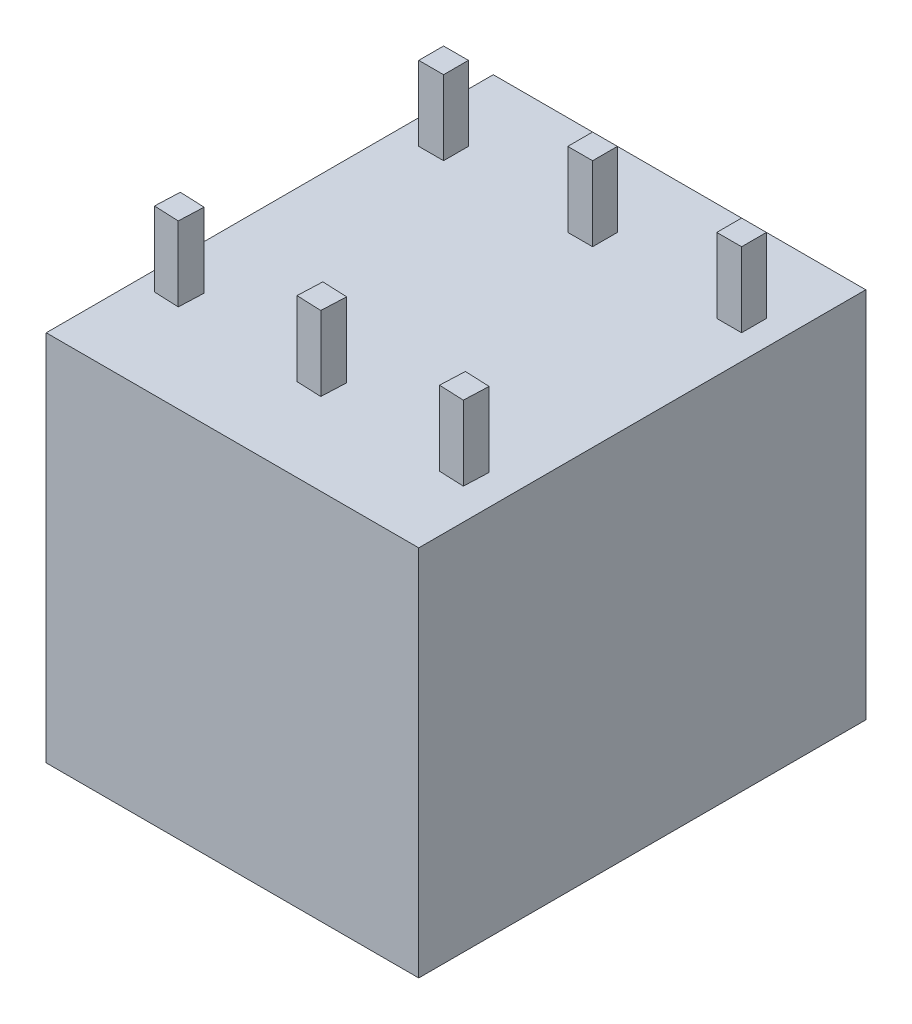
ISO-10303-21;
HEADER;
FILE_DESCRIPTION(('STEP AP214'),'2;1');
FILE_NAME('part.step','',(''),(''),'','','');
FILE_SCHEMA(('AUTOMOTIVE_DESIGN { 1 0 10303 214 1 1 1 1 }'));
ENDSEC;
DATA;
#1=APPLICATION_CONTEXT('core data for automotive mechanical design processes');
#2=APPLICATION_PROTOCOL_DEFINITION('international standard','automotive_design',2000,#1);
#3=PRODUCT_CONTEXT('',#1,'mechanical');
#4=PRODUCT('Part','Part','',(#3));
#5=PRODUCT_RELATED_PRODUCT_CATEGORY('part','',(#4));
#6=PRODUCT_DEFINITION_FORMATION('','',#4);
#7=PRODUCT_DEFINITION_CONTEXT('part definition',#1,'design');
#8=PRODUCT_DEFINITION('design','',#6,#7);
#9=PRODUCT_DEFINITION_SHAPE('','',#8);
#10=(LENGTH_UNIT() NAMED_UNIT(*) SI_UNIT(.MILLI.,.METRE.));
#11=(NAMED_UNIT(*) PLANE_ANGLE_UNIT() SI_UNIT($,.RADIAN.));
#12=(NAMED_UNIT(*) SI_UNIT($,.STERADIAN.) SOLID_ANGLE_UNIT());
#13=UNCERTAINTY_MEASURE_WITH_UNIT(LENGTH_MEASURE(1.E-05),#10,'distance_accuracy_value','');
#14=(GEOMETRIC_REPRESENTATION_CONTEXT(3) GLOBAL_UNCERTAINTY_ASSIGNED_CONTEXT((#13)) GLOBAL_UNIT_ASSIGNED_CONTEXT((#10,
#11,#12)) REPRESENTATION_CONTEXT('',''));
#15=CARTESIAN_POINT('',(0.,0.,0.));
#16=DIRECTION('',(0.,0.,1.));
#17=DIRECTION('',(1.,0.,0.));
#18=AXIS2_PLACEMENT_3D('',#15,#16,#17);
#19=CARTESIAN_POINT('',(0.,15.,0.));
#20=DIRECTION('',(0.,-1.,0.));
#21=DIRECTION('',(0.,0.,-1.));
#22=AXIS2_PLACEMENT_3D('',#19,#20,#21);
#23=PLANE('',#22);
#24=DIRECTION('',(0.999093584908237,0.,0.0425676942669896));
#25=VECTOR('',#24,1.);
#26=CARTESIAN_POINT('',(6.75184515513216,15.,-3.3459800446865));
#27=LINE('',#26,#25);
#28=CARTESIAN_POINT('',(6.75184515513216,15.,-3.3459800446865));
#29=VERTEX_POINT('',#28);
#30=CARTESIAN_POINT('',(7.7509387400404,15.,-3.30341235041951));
#31=VERTEX_POINT('',#30);
#32=EDGE_CURVE('E251',#29,#31,#27,.T.);
#33=ORIENTED_EDGE('',*,*,#32,.F.);
#34=DIRECTION('',(-0.0425676942669914,0.,0.999093584908237));
#35=VECTOR('',#34,1.);
#36=CARTESIAN_POINT('',(6.75184515513216,15.,-3.3459800446865));
#37=LINE('',#36,#35);
#38=CARTESIAN_POINT('',(6.79441284939915,15.,-4.34507362959474));
#39=VERTEX_POINT('',#38);
#40=EDGE_CURVE('E264',#39,#29,#37,.T.);
#41=ORIENTED_EDGE('',*,*,#40,.F.);
#42=DIRECTION('',(-0.999093584908237,0.,-0.0425676942669897));
#43=VECTOR('',#42,1.);
#44=CARTESIAN_POINT('',(6.79441284939915,15.,-4.34507362959474));
#45=LINE('',#44,#43);
#46=CARTESIAN_POINT('',(7.79350643430738,15.,-4.30250593532775));
#47=VERTEX_POINT('',#46);
#48=EDGE_CURVE('E273',#47,#39,#45,.T.);
#49=ORIENTED_EDGE('',*,*,#48,.F.);
#50=DIRECTION('',(0.0425676942669879,0.,-0.999093584908237));
#51=VECTOR('',#50,1.);
#52=CARTESIAN_POINT('',(7.7509387400404,15.,-3.30341235041951));
#53=LINE('',#52,#51);
#54=EDGE_CURVE('E254',#31,#47,#53,.T.);
#55=ORIENTED_EDGE('',*,*,#54,.F.);
#56=EDGE_LOOP('',(#33,#41,#49,#55));
#57=FACE_BOUND('',#56,.T.);
#58=DIRECTION('',(0.,0.,-1.));
#59=VECTOR('',#58,1.);
#60=CARTESIAN_POINT('',(14.,15.,-15.));
#61=LINE('',#60,#59);
#62=CARTESIAN_POINT('',(14.,15.,-14.));
#63=VERTEX_POINT('',#62);
#64=CARTESIAN_POINT('',(14.,15.,-15.));
#65=VERTEX_POINT('',#64);
#66=EDGE_CURVE('E322',#63,#65,#61,.T.);
#67=ORIENTED_EDGE('',*,*,#66,.F.);
#68=DIRECTION('',(1.,0.,0.));
#69=VECTOR('',#68,1.);
#70=CARTESIAN_POINT('',(14.,15.,-14.));
#71=LINE('',#70,#69);
#72=CARTESIAN_POINT('',(13.,15.,-14.));
#73=VERTEX_POINT('',#72);
#74=EDGE_CURVE('E327',#73,#63,#71,.T.);
#75=ORIENTED_EDGE('',*,*,#74,.F.);
#76=DIRECTION('',(0.,0.,1.));
#77=VECTOR('',#76,1.);
#78=CARTESIAN_POINT('',(13.,15.,-15.));
#79=LINE('',#78,#77);
#80=CARTESIAN_POINT('',(13.,15.,-15.));
#81=VERTEX_POINT('',#80);
#82=EDGE_CURVE('E339',#81,#73,#79,.T.);
#83=ORIENTED_EDGE('',*,*,#82,.F.);
#84=DIRECTION('',(-1.,0.,0.));
#85=VECTOR('',#84,1.);
#86=CARTESIAN_POINT('',(14.,15.,-15.));
#87=LINE('',#86,#85);
#88=EDGE_CURVE('E336',#65,#81,#87,.T.);
#89=ORIENTED_EDGE('',*,*,#88,.F.);
#90=EDGE_LOOP('',(#67,#75,#83,#89));
#91=FACE_BOUND('',#90,.T.);
#92=DIRECTION('',(0.,0.,1.));
#93=VECTOR('',#92,1.);
#94=CARTESIAN_POINT('',(0.999999999999995,15.,-15.));
#95=LINE('',#94,#93);
#96=CARTESIAN_POINT('',(0.999999999999995,15.,-15.));
#97=VERTEX_POINT('',#96);
#98=CARTESIAN_POINT('',(0.999999999999995,15.,-14.));
#99=VERTEX_POINT('',#98);
#100=EDGE_CURVE('E388',#97,#99,#95,.T.);
#101=ORIENTED_EDGE('',*,*,#100,.F.);
#102=DIRECTION('',(-1.,0.,0.));
#103=VECTOR('',#102,1.);
#104=CARTESIAN_POINT('',(0.999999999999995,15.,-15.));
#105=LINE('',#104,#103);
#106=CARTESIAN_POINT('',(1.99999999999999,15.,-15.));
#107=VERTEX_POINT('',#106);
#108=EDGE_CURVE('E393',#107,#97,#105,.T.);
#109=ORIENTED_EDGE('',*,*,#108,.F.);
#110=DIRECTION('',(0.,0.,-1.));
#111=VECTOR('',#110,1.);
#112=CARTESIAN_POINT('',(1.99999999999999,15.,-15.));
#113=LINE('',#112,#111);
#114=CARTESIAN_POINT('',(1.99999999999999,15.,-14.));
#115=VERTEX_POINT('',#114);
#116=EDGE_CURVE('E405',#115,#107,#113,.T.);
#117=ORIENTED_EDGE('',*,*,#116,.F.);
#118=DIRECTION('',(1.,0.,0.));
#119=VECTOR('',#118,1.);
#120=CARTESIAN_POINT('',(0.999999999999995,15.,-14.));
#121=LINE('',#120,#119);
#122=EDGE_CURVE('E402',#99,#115,#121,.T.);
#123=ORIENTED_EDGE('',*,*,#122,.F.);
#124=EDGE_LOOP('',(#101,#109,#117,#123));
#125=FACE_BOUND('',#124,.T.);
#126=DIRECTION('',(0.,0.,1.));
#127=VECTOR('',#126,1.);
#128=CARTESIAN_POINT('',(0.,15.,0.));
#129=LINE('',#128,#127);
#130=CARTESIAN_POINT('',(0.,15.,-18.));
#131=VERTEX_POINT('',#130);
#132=CARTESIAN_POINT('',(0.,15.,0.));
#133=VERTEX_POINT('',#132);
#134=EDGE_CURVE('E422',#131,#133,#129,.T.);
#135=ORIENTED_EDGE('',*,*,#134,.T.);
#136=DIRECTION('',(1.,0.,0.));
#137=VECTOR('',#136,1.);
#138=CARTESIAN_POINT('',(0.,15.,0.));
#139=LINE('',#138,#137);
#140=CARTESIAN_POINT('',(15.,15.,0.));
#141=VERTEX_POINT('',#140);
#142=EDGE_CURVE('E425',#133,#141,#139,.T.);
#143=ORIENTED_EDGE('',*,*,#142,.T.);
#144=DIRECTION('',(0.,0.,-1.));
#145=VECTOR('',#144,1.);
#146=CARTESIAN_POINT('',(15.,15.,0.));
#147=LINE('',#146,#145);
#148=CARTESIAN_POINT('',(15.,15.,-18.));
#149=VERTEX_POINT('',#148);
#150=EDGE_CURVE('E428',#141,#149,#147,.T.);
#151=ORIENTED_EDGE('',*,*,#150,.T.);
#152=DIRECTION('',(-1.,0.,0.));
#153=VECTOR('',#152,1.);
#154=CARTESIAN_POINT('',(0.,15.,-18.));
#155=LINE('',#154,#153);
#156=EDGE_CURVE('E430',#149,#131,#155,.T.);
#157=ORIENTED_EDGE('',*,*,#156,.T.);
#158=EDGE_LOOP('',(#135,#143,#151,#157));
#159=FACE_BOUND('',#158,.T.);
#160=DIRECTION('',(0.,0.,1.));
#161=VECTOR('',#160,1.);
#162=CARTESIAN_POINT('',(6.99999999999999,15.,-15.));
#163=LINE('',#162,#161);
#164=CARTESIAN_POINT('',(6.99999999999999,15.,-15.));
#165=VERTEX_POINT('',#164);
#166=CARTESIAN_POINT('',(6.99999999999999,15.,-14.));
#167=VERTEX_POINT('',#166);
#168=EDGE_CURVE('E355',#165,#167,#163,.T.);
#169=ORIENTED_EDGE('',*,*,#168,.F.);
#170=DIRECTION('',(-1.,0.,0.));
#171=VECTOR('',#170,1.);
#172=CARTESIAN_POINT('',(6.99999999999999,15.,-15.));
#173=LINE('',#172,#171);
#174=CARTESIAN_POINT('',(7.99999999999999,15.,-15.));
#175=VERTEX_POINT('',#174);
#176=EDGE_CURVE('E360',#175,#165,#173,.T.);
#177=ORIENTED_EDGE('',*,*,#176,.F.);
#178=DIRECTION('',(0.,0.,-1.));
#179=VECTOR('',#178,1.);
#180=CARTESIAN_POINT('',(7.99999999999999,15.,-15.));
#181=LINE('',#180,#179);
#182=CARTESIAN_POINT('',(7.99999999999999,15.,-14.));
#183=VERTEX_POINT('',#182);
#184=EDGE_CURVE('E372',#183,#175,#181,.T.);
#185=ORIENTED_EDGE('',*,*,#184,.F.);
#186=DIRECTION('',(1.,0.,0.));
#187=VECTOR('',#186,1.);
#188=CARTESIAN_POINT('',(6.99999999999999,15.,-14.));
#189=LINE('',#188,#187);
#190=EDGE_CURVE('E369',#167,#183,#189,.T.);
#191=ORIENTED_EDGE('',*,*,#190,.F.);
#192=EDGE_LOOP('',(#169,#177,#185,#191));
#193=FACE_BOUND('',#192,.T.);
#194=DIRECTION('',(0.999093584908237,0.,0.0425676942669896));
#195=VECTOR('',#194,1.);
#196=CARTESIAN_POINT('',(13.7455002494898,15.,-3.04800618481756));
#197=LINE('',#196,#195);
#198=CARTESIAN_POINT('',(12.7464066645816,15.,-3.09057387908455));
#199=VERTEX_POINT('',#198);
#200=CARTESIAN_POINT('',(13.7455002494898,15.,-3.04800618481756));
#201=VERTEX_POINT('',#200);
#202=EDGE_CURVE('E289',#199,#201,#197,.T.);
#203=ORIENTED_EDGE('',*,*,#202,.F.);
#204=DIRECTION('',(-0.0425676942669914,0.,0.999093584908237));
#205=VECTOR('',#204,1.);
#206=CARTESIAN_POINT('',(12.7464066645816,15.,-3.09057387908455));
#207=LINE('',#206,#205);
#208=CARTESIAN_POINT('',(12.7889743588486,15.,-4.08966746399279));
#209=VERTEX_POINT('',#208);
#210=EDGE_CURVE('E294',#209,#199,#207,.T.);
#211=ORIENTED_EDGE('',*,*,#210,.F.);
#212=DIRECTION('',(-0.999093584908237,0.,-0.0425676942669898));
#213=VECTOR('',#212,1.);
#214=CARTESIAN_POINT('',(13.7880679437568,15.,-4.0470997697258));
#215=LINE('',#214,#213);
#216=CARTESIAN_POINT('',(13.7880679437568,15.,-4.0470997697258));
#217=VERTEX_POINT('',#216);
#218=EDGE_CURVE('E306',#217,#209,#215,.T.);
#219=ORIENTED_EDGE('',*,*,#218,.F.);
#220=DIRECTION('',(0.0425676942669879,0.,-0.999093584908237));
#221=VECTOR('',#220,1.);
#222=CARTESIAN_POINT('',(13.7455002494898,15.,-3.04800618481756));
#223=LINE('',#222,#221);
#224=EDGE_CURVE('E303',#201,#217,#223,.T.);
#225=ORIENTED_EDGE('',*,*,#224,.F.);
#226=EDGE_LOOP('',(#203,#211,#219,#225));
#227=FACE_BOUND('',#226,.T.);
#228=DIRECTION('',(0.999093584908237,0.,0.0425676942669897));
#229=VECTOR('',#228,1.);
#230=CARTESIAN_POINT('',(0.757283645682741,15.,-3.60138621028844));
#231=LINE('',#230,#229);
#232=CARTESIAN_POINT('',(0.757283645682741,15.,-3.60138621028844));
#233=VERTEX_POINT('',#232);
#234=CARTESIAN_POINT('',(1.75637723059098,15.,-3.55881851602145));
#235=VERTEX_POINT('',#234);
#236=EDGE_CURVE('E250',#233,#235,#231,.T.);
#237=ORIENTED_EDGE('',*,*,#236,.F.);
#238=DIRECTION('',(-0.0425676942669905,0.,0.999093584908237));
#239=VECTOR('',#238,1.);
#240=CARTESIAN_POINT('',(0.757283645682741,15.,-3.60138621028844));
#241=LINE('',#240,#239);
#242=CARTESIAN_POINT('',(0.799851339949732,15.,-4.60047979519667));
#243=VERTEX_POINT('',#242);
#244=EDGE_CURVE('E247',#243,#233,#241,.T.);
#245=ORIENTED_EDGE('',*,*,#244,.F.);
#246=DIRECTION('',(-0.999093584908237,0.,-0.0425676942669897));
#247=VECTOR('',#246,1.);
#248=CARTESIAN_POINT('',(0.799851339949732,15.,-4.60047979519667));
#249=LINE('',#248,#247);
#250=CARTESIAN_POINT('',(1.79894492485797,15.,-4.55791210092968));
#251=VERTEX_POINT('',#250);
#252=EDGE_CURVE('E65',#251,#243,#249,.T.);
#253=ORIENTED_EDGE('',*,*,#252,.F.);
#254=DIRECTION('',(0.0425676942669892,0.,-0.999093584908237));
#255=VECTOR('',#254,1.);
#256=CARTESIAN_POINT('',(1.75637723059098,15.,-3.55881851602145));
#257=LINE('',#256,#255);
#258=EDGE_CURVE('E60',#235,#251,#257,.T.);
#259=ORIENTED_EDGE('',*,*,#258,.F.);
#260=EDGE_LOOP('',(#237,#245,#253,#259));
#261=FACE_BOUND('',#260,.T.);
#262=ADVANCED_FACE('F45',(#57,#91,#125,#159,#193,#227,#261),#23,.F.);
#263=CARTESIAN_POINT('',(0.,15.,0.));
#264=DIRECTION('',(1.,0.,0.));
#265=DIRECTION('',(0.,0.,-1.));
#266=AXIS2_PLACEMENT_3D('',#263,#264,#265);
#267=PLANE('',#266);
#268=DIRECTION('',(0.,0.,1.));
#269=VECTOR('',#268,1.);
#270=CARTESIAN_POINT('',(0.,0.,0.));
#271=LINE('',#270,#269);
#272=CARTESIAN_POINT('',(0.,0.,-18.));
#273=VERTEX_POINT('',#272);
#274=CARTESIAN_POINT('',(0.,0.,0.));
#275=VERTEX_POINT('',#274);
#276=EDGE_CURVE('E421',#273,#275,#271,.T.);
#277=ORIENTED_EDGE('',*,*,#276,.T.);
#278=DIRECTION('',(0.,-1.,0.));
#279=VECTOR('',#278,1.);
#280=CARTESIAN_POINT('',(0.,15.,0.));
#281=LINE('',#280,#279);
#282=EDGE_CURVE('E11',#133,#275,#281,.T.);
#283=ORIENTED_EDGE('',*,*,#282,.F.);
#284=ORIENTED_EDGE('',*,*,#134,.F.);
#285=DIRECTION('',(0.,-1.,0.));
#286=VECTOR('',#285,1.);
#287=CARTESIAN_POINT('',(0.,15.,-18.));
#288=LINE('',#287,#286);
#289=EDGE_CURVE('E432',#131,#273,#288,.T.);
#290=ORIENTED_EDGE('',*,*,#289,.T.);
#291=EDGE_LOOP('',(#277,#283,#284,#290));
#292=FACE_BOUND('',#291,.T.);
#293=ADVANCED_FACE('F47',(#292),#267,.F.);
#294=CARTESIAN_POINT('',(0.,15.,0.));
#295=DIRECTION('',(0.,0.,-1.));
#296=DIRECTION('',(-1.,0.,0.));
#297=AXIS2_PLACEMENT_3D('',#294,#295,#296);
#298=PLANE('',#297);
#299=DIRECTION('',(1.,0.,0.));
#300=VECTOR('',#299,1.);
#301=CARTESIAN_POINT('',(0.,0.,0.));
#302=LINE('',#301,#300);
#303=CARTESIAN_POINT('',(15.,0.,0.));
#304=VERTEX_POINT('',#303);
#305=EDGE_CURVE('E435',#275,#304,#302,.T.);
#306=ORIENTED_EDGE('',*,*,#305,.T.);
#307=DIRECTION('',(0.,-1.,0.));
#308=VECTOR('',#307,1.);
#309=CARTESIAN_POINT('',(15.,15.,0.));
#310=LINE('',#309,#308);
#311=EDGE_CURVE('E53',#141,#304,#310,.T.);
#312=ORIENTED_EDGE('',*,*,#311,.F.);
#313=ORIENTED_EDGE('',*,*,#142,.F.);
#314=ORIENTED_EDGE('',*,*,#282,.T.);
#315=EDGE_LOOP('',(#306,#312,#313,#314));
#316=FACE_BOUND('',#315,.T.);
#317=ADVANCED_FACE('F465',(#316),#298,.F.);
#318=CARTESIAN_POINT('',(15.,15.,0.));
#319=DIRECTION('',(-1.,0.,0.));
#320=DIRECTION('',(0.,0.,1.));
#321=AXIS2_PLACEMENT_3D('',#318,#319,#320);
#322=PLANE('',#321);
#323=DIRECTION('',(0.,0.,-1.));
#324=VECTOR('',#323,1.);
#325=CARTESIAN_POINT('',(15.,0.,0.));
#326=LINE('',#325,#324);
#327=CARTESIAN_POINT('',(15.,0.,-18.));
#328=VERTEX_POINT('',#327);
#329=EDGE_CURVE('E437',#304,#328,#326,.T.);
#330=ORIENTED_EDGE('',*,*,#329,.T.);
#331=DIRECTION('',(0.,-1.,0.));
#332=VECTOR('',#331,1.);
#333=CARTESIAN_POINT('',(15.,15.,-18.));
#334=LINE('',#333,#332);
#335=EDGE_CURVE('E442',#149,#328,#334,.T.);
#336=ORIENTED_EDGE('',*,*,#335,.F.);
#337=ORIENTED_EDGE('',*,*,#150,.F.);
#338=ORIENTED_EDGE('',*,*,#311,.T.);
#339=EDGE_LOOP('',(#330,#336,#337,#338));
#340=FACE_BOUND('',#339,.T.);
#341=ADVANCED_FACE('F449',(#340),#322,.F.);
#342=CARTESIAN_POINT('',(0.,15.,-18.));
#343=DIRECTION('',(0.,0.,1.));
#344=DIRECTION('',(1.,0.,0.));
#345=AXIS2_PLACEMENT_3D('',#342,#343,#344);
#346=PLANE('',#345);
#347=DIRECTION('',(-1.,0.,0.));
#348=VECTOR('',#347,1.);
#349=CARTESIAN_POINT('',(0.,0.,-18.));
#350=LINE('',#349,#348);
#351=EDGE_CURVE('E426',#328,#273,#350,.T.);
#352=ORIENTED_EDGE('',*,*,#351,.T.);
#353=ORIENTED_EDGE('',*,*,#289,.F.);
#354=ORIENTED_EDGE('',*,*,#156,.F.);
#355=ORIENTED_EDGE('',*,*,#335,.T.);
#356=EDGE_LOOP('',(#352,#353,#354,#355));
#357=FACE_BOUND('',#356,.T.);
#358=ADVANCED_FACE('F458',(#357),#346,.F.);
#359=CARTESIAN_POINT('',(0.,0.,0.));
#360=DIRECTION('',(0.,-1.,0.));
#361=DIRECTION('',(0.,0.,-1.));
#362=AXIS2_PLACEMENT_3D('',#359,#360,#361);
#363=PLANE('',#362);
#364=ORIENTED_EDGE('',*,*,#276,.F.);
#365=ORIENTED_EDGE('',*,*,#351,.F.);
#366=ORIENTED_EDGE('',*,*,#329,.F.);
#367=ORIENTED_EDGE('',*,*,#305,.F.);
#368=EDGE_LOOP('',(#364,#365,#366,#367));
#369=FACE_BOUND('',#368,.T.);
#370=ADVANCED_FACE('F455',(#369),#363,.T.);
#371=CARTESIAN_POINT('',(0.999999999999995,18.,-15.));
#372=DIRECTION('',(1.,0.,0.));
#373=DIRECTION('',(0.,0.,-1.));
#374=AXIS2_PLACEMENT_3D('',#371,#372,#373);
#375=PLANE('',#374);
#376=ORIENTED_EDGE('',*,*,#100,.T.);
#377=DIRECTION('',(0.,-1.,0.));
#378=VECTOR('',#377,1.);
#379=CARTESIAN_POINT('',(0.999999999999995,18.,-14.));
#380=LINE('',#379,#378);
#381=CARTESIAN_POINT('',(0.999999999999995,18.,-14.));
#382=VERTEX_POINT('',#381);
#383=EDGE_CURVE('E418',#382,#99,#380,.T.);
#384=ORIENTED_EDGE('',*,*,#383,.F.);
#385=DIRECTION('',(0.,0.,1.));
#386=VECTOR('',#385,1.);
#387=CARTESIAN_POINT('',(0.999999999999995,18.,-15.));
#388=LINE('',#387,#386);
#389=CARTESIAN_POINT('',(0.999999999999995,18.,-15.));
#390=VERTEX_POINT('',#389);
#391=EDGE_CURVE('E389',#390,#382,#388,.T.);
#392=ORIENTED_EDGE('',*,*,#391,.F.);
#393=DIRECTION('',(0.,-1.,0.));
#394=VECTOR('',#393,1.);
#395=CARTESIAN_POINT('',(0.999999999999995,18.,-15.));
#396=LINE('',#395,#394);
#397=EDGE_CURVE('E399',#390,#97,#396,.T.);
#398=ORIENTED_EDGE('',*,*,#397,.T.);
#399=EDGE_LOOP('',(#376,#384,#392,#398));
#400=FACE_BOUND('',#399,.T.);
#401=ADVANCED_FACE('F480',(#400),#375,.F.);
#402=CARTESIAN_POINT('',(0.999999999999995,18.,-14.));
#403=DIRECTION('',(0.,0.,-1.));
#404=DIRECTION('',(-1.,0.,0.));
#405=AXIS2_PLACEMENT_3D('',#402,#403,#404);
#406=PLANE('',#405);
#407=ORIENTED_EDGE('',*,*,#122,.T.);
#408=DIRECTION('',(0.,-1.,0.));
#409=VECTOR('',#408,1.);
#410=CARTESIAN_POINT('',(1.99999999999999,18.,-14.));
#411=LINE('',#410,#409);
#412=CARTESIAN_POINT('',(1.99999999999999,18.,-14.));
#413=VERTEX_POINT('',#412);
#414=EDGE_CURVE('E415',#413,#115,#411,.T.);
#415=ORIENTED_EDGE('',*,*,#414,.F.);
#416=DIRECTION('',(1.,0.,0.));
#417=VECTOR('',#416,1.);
#418=CARTESIAN_POINT('',(0.999999999999995,18.,-14.));
#419=LINE('',#418,#417);
#420=EDGE_CURVE('E392',#382,#413,#419,.T.);
#421=ORIENTED_EDGE('',*,*,#420,.F.);
#422=ORIENTED_EDGE('',*,*,#383,.T.);
#423=EDGE_LOOP('',(#407,#415,#421,#422));
#424=FACE_BOUND('',#423,.T.);
#425=ADVANCED_FACE('F545',(#424),#406,.F.);
#426=CARTESIAN_POINT('',(1.99999999999999,18.,-15.));
#427=DIRECTION('',(-1.,0.,0.));
#428=DIRECTION('',(0.,0.,1.));
#429=AXIS2_PLACEMENT_3D('',#426,#427,#428);
#430=PLANE('',#429);
#431=ORIENTED_EDGE('',*,*,#116,.T.);
#432=DIRECTION('',(0.,-1.,0.));
#433=VECTOR('',#432,1.);
#434=CARTESIAN_POINT('',(1.99999999999999,18.,-15.));
#435=LINE('',#434,#433);
#436=CARTESIAN_POINT('',(1.99999999999999,18.,-15.));
#437=VERTEX_POINT('',#436);
#438=EDGE_CURVE('E412',#437,#107,#435,.T.);
#439=ORIENTED_EDGE('',*,*,#438,.F.);
#440=DIRECTION('',(0.,0.,-1.));
#441=VECTOR('',#440,1.);
#442=CARTESIAN_POINT('',(1.99999999999999,18.,-15.));
#443=LINE('',#442,#441);
#444=EDGE_CURVE('E395',#413,#437,#443,.T.);
#445=ORIENTED_EDGE('',*,*,#444,.F.);
#446=ORIENTED_EDGE('',*,*,#414,.T.);
#447=EDGE_LOOP('',(#431,#439,#445,#446));
#448=FACE_BOUND('',#447,.T.);
#449=ADVANCED_FACE('F552',(#448),#430,.F.);
#450=CARTESIAN_POINT('',(0.999999999999995,18.,-15.));
#451=DIRECTION('',(0.,0.,1.));
#452=DIRECTION('',(1.,0.,0.));
#453=AXIS2_PLACEMENT_3D('',#450,#451,#452);
#454=PLANE('',#453);
#455=ORIENTED_EDGE('',*,*,#108,.T.);
#456=ORIENTED_EDGE('',*,*,#397,.F.);
#457=DIRECTION('',(-1.,0.,0.));
#458=VECTOR('',#457,1.);
#459=CARTESIAN_POINT('',(0.999999999999995,18.,-15.));
#460=LINE('',#459,#458);
#461=EDGE_CURVE('E397',#437,#390,#460,.T.);
#462=ORIENTED_EDGE('',*,*,#461,.F.);
#463=ORIENTED_EDGE('',*,*,#438,.T.);
#464=EDGE_LOOP('',(#455,#456,#462,#463));
#465=FACE_BOUND('',#464,.T.);
#466=ADVANCED_FACE('F559',(#465),#454,.F.);
#467=CARTESIAN_POINT('',(0.,18.,0.));
#468=DIRECTION('',(0.,1.,0.));
#469=DIRECTION('',(0.,0.,1.));
#470=AXIS2_PLACEMENT_3D('',#467,#468,#469);
#471=PLANE('',#470);
#472=ORIENTED_EDGE('',*,*,#391,.T.);
#473=ORIENTED_EDGE('',*,*,#420,.T.);
#474=ORIENTED_EDGE('',*,*,#444,.T.);
#475=ORIENTED_EDGE('',*,*,#461,.T.);
#476=EDGE_LOOP('',(#472,#473,#474,#475));
#477=FACE_BOUND('',#476,.T.);
#478=ADVANCED_FACE('F567',(#477),#471,.T.);
#479=CARTESIAN_POINT('',(6.99999999999999,18.,-15.));
#480=DIRECTION('',(1.,0.,0.));
#481=DIRECTION('',(0.,0.,-1.));
#482=AXIS2_PLACEMENT_3D('',#479,#480,#481);
#483=PLANE('',#482);
#484=ORIENTED_EDGE('',*,*,#168,.T.);
#485=DIRECTION('',(0.,-1.,0.));
#486=VECTOR('',#485,1.);
#487=CARTESIAN_POINT('',(6.99999999999999,18.,-14.));
#488=LINE('',#487,#486);
#489=CARTESIAN_POINT('',(6.99999999999999,18.,-14.));
#490=VERTEX_POINT('',#489);
#491=EDGE_CURVE('E385',#490,#167,#488,.T.);
#492=ORIENTED_EDGE('',*,*,#491,.F.);
#493=DIRECTION('',(0.,0.,1.));
#494=VECTOR('',#493,1.);
#495=CARTESIAN_POINT('',(6.99999999999999,18.,-15.));
#496=LINE('',#495,#494);
#497=CARTESIAN_POINT('',(6.99999999999999,18.,-15.));
#498=VERTEX_POINT('',#497);
#499=EDGE_CURVE('E356',#498,#490,#496,.T.);
#500=ORIENTED_EDGE('',*,*,#499,.F.);
#501=DIRECTION('',(0.,-1.,0.));
#502=VECTOR('',#501,1.);
#503=CARTESIAN_POINT('',(6.99999999999999,18.,-15.));
#504=LINE('',#503,#502);
#505=EDGE_CURVE('E366',#498,#165,#504,.T.);
#506=ORIENTED_EDGE('',*,*,#505,.T.);
#507=EDGE_LOOP('',(#484,#492,#500,#506));
#508=FACE_BOUND('',#507,.T.);
#509=ADVANCED_FACE('F575',(#508),#483,.F.);
#510=CARTESIAN_POINT('',(6.99999999999999,18.,-14.));
#511=DIRECTION('',(0.,0.,-1.));
#512=DIRECTION('',(-1.,0.,0.));
#513=AXIS2_PLACEMENT_3D('',#510,#511,#512);
#514=PLANE('',#513);
#515=ORIENTED_EDGE('',*,*,#190,.T.);
#516=DIRECTION('',(0.,-1.,0.));
#517=VECTOR('',#516,1.);
#518=CARTESIAN_POINT('',(7.99999999999999,18.,-14.));
#519=LINE('',#518,#517);
#520=CARTESIAN_POINT('',(7.99999999999999,18.,-14.));
#521=VERTEX_POINT('',#520);
#522=EDGE_CURVE('E382',#521,#183,#519,.T.);
#523=ORIENTED_EDGE('',*,*,#522,.F.);
#524=DIRECTION('',(1.,0.,0.));
#525=VECTOR('',#524,1.);
#526=CARTESIAN_POINT('',(6.99999999999999,18.,-14.));
#527=LINE('',#526,#525);
#528=EDGE_CURVE('E359',#490,#521,#527,.T.);
#529=ORIENTED_EDGE('',*,*,#528,.F.);
#530=ORIENTED_EDGE('',*,*,#491,.T.);
#531=EDGE_LOOP('',(#515,#523,#529,#530));
#532=FACE_BOUND('',#531,.T.);
#533=ADVANCED_FACE('F583',(#532),#514,.F.);
#534=CARTESIAN_POINT('',(7.99999999999999,18.,-15.));
#535=DIRECTION('',(-1.,0.,0.));
#536=DIRECTION('',(0.,0.,1.));
#537=AXIS2_PLACEMENT_3D('',#534,#535,#536);
#538=PLANE('',#537);
#539=ORIENTED_EDGE('',*,*,#184,.T.);
#540=DIRECTION('',(0.,-1.,0.));
#541=VECTOR('',#540,1.);
#542=CARTESIAN_POINT('',(7.99999999999999,18.,-15.));
#543=LINE('',#542,#541);
#544=CARTESIAN_POINT('',(7.99999999999999,18.,-15.));
#545=VERTEX_POINT('',#544);
#546=EDGE_CURVE('E379',#545,#175,#543,.T.);
#547=ORIENTED_EDGE('',*,*,#546,.F.);
#548=DIRECTION('',(0.,0.,-1.));
#549=VECTOR('',#548,1.);
#550=CARTESIAN_POINT('',(7.99999999999999,18.,-15.));
#551=LINE('',#550,#549);
#552=EDGE_CURVE('E362',#521,#545,#551,.T.);
#553=ORIENTED_EDGE('',*,*,#552,.F.);
#554=ORIENTED_EDGE('',*,*,#522,.T.);
#555=EDGE_LOOP('',(#539,#547,#553,#554));
#556=FACE_BOUND('',#555,.T.);
#557=ADVANCED_FACE('F591',(#556),#538,.F.);
#558=CARTESIAN_POINT('',(6.99999999999999,18.,-15.));
#559=DIRECTION('',(0.,0.,1.));
#560=DIRECTION('',(1.,0.,0.));
#561=AXIS2_PLACEMENT_3D('',#558,#559,#560);
#562=PLANE('',#561);
#563=ORIENTED_EDGE('',*,*,#176,.T.);
#564=ORIENTED_EDGE('',*,*,#505,.F.);
#565=DIRECTION('',(-1.,0.,0.));
#566=VECTOR('',#565,1.);
#567=CARTESIAN_POINT('',(6.99999999999999,18.,-15.));
#568=LINE('',#567,#566);
#569=EDGE_CURVE('E364',#545,#498,#568,.T.);
#570=ORIENTED_EDGE('',*,*,#569,.F.);
#571=ORIENTED_EDGE('',*,*,#546,.T.);
#572=EDGE_LOOP('',(#563,#564,#570,#571));
#573=FACE_BOUND('',#572,.T.);
#574=ADVANCED_FACE('F599',(#573),#562,.F.);
#575=CARTESIAN_POINT('',(0.,18.,0.));
#576=DIRECTION('',(0.,1.,0.));
#577=DIRECTION('',(0.,0.,1.));
#578=AXIS2_PLACEMENT_3D('',#575,#576,#577);
#579=PLANE('',#578);
#580=ORIENTED_EDGE('',*,*,#499,.T.);
#581=ORIENTED_EDGE('',*,*,#528,.T.);
#582=ORIENTED_EDGE('',*,*,#552,.T.);
#583=ORIENTED_EDGE('',*,*,#569,.T.);
#584=EDGE_LOOP('',(#580,#581,#582,#583));
#585=FACE_BOUND('',#584,.T.);
#586=ADVANCED_FACE('F607',(#585),#579,.T.);
#587=CARTESIAN_POINT('',(14.,18.,-15.));
#588=DIRECTION('',(-1.,0.,0.));
#589=DIRECTION('',(0.,0.,1.));
#590=AXIS2_PLACEMENT_3D('',#587,#588,#589);
#591=PLANE('',#590);
#592=ORIENTED_EDGE('',*,*,#66,.T.);
#593=DIRECTION('',(0.,-1.,0.));
#594=VECTOR('',#593,1.);
#595=CARTESIAN_POINT('',(14.,18.,-15.));
#596=LINE('',#595,#594);
#597=CARTESIAN_POINT('',(14.,18.,-15.));
#598=VERTEX_POINT('',#597);
#599=EDGE_CURVE('E352',#598,#65,#596,.T.);
#600=ORIENTED_EDGE('',*,*,#599,.F.);
#601=DIRECTION('',(0.,0.,-1.));
#602=VECTOR('',#601,1.);
#603=CARTESIAN_POINT('',(14.,18.,-15.));
#604=LINE('',#603,#602);
#605=CARTESIAN_POINT('',(14.,18.,-14.));
#606=VERTEX_POINT('',#605);
#607=EDGE_CURVE('E323',#606,#598,#604,.T.);
#608=ORIENTED_EDGE('',*,*,#607,.F.);
#609=DIRECTION('',(0.,-1.,0.));
#610=VECTOR('',#609,1.);
#611=CARTESIAN_POINT('',(14.,18.,-14.));
#612=LINE('',#611,#610);
#613=EDGE_CURVE('E333',#606,#63,#612,.T.);
#614=ORIENTED_EDGE('',*,*,#613,.T.);
#615=EDGE_LOOP('',(#592,#600,#608,#614));
#616=FACE_BOUND('',#615,.T.);
#617=ADVANCED_FACE('F615',(#616),#591,.F.);
#618=CARTESIAN_POINT('',(14.,18.,-15.));
#619=DIRECTION('',(0.,0.,1.));
#620=DIRECTION('',(1.,0.,0.));
#621=AXIS2_PLACEMENT_3D('',#618,#619,#620);
#622=PLANE('',#621);
#623=ORIENTED_EDGE('',*,*,#88,.T.);
#624=DIRECTION('',(0.,-1.,0.));
#625=VECTOR('',#624,1.);
#626=CARTESIAN_POINT('',(13.,18.,-15.));
#627=LINE('',#626,#625);
#628=CARTESIAN_POINT('',(13.,18.,-15.));
#629=VERTEX_POINT('',#628);
#630=EDGE_CURVE('E349',#629,#81,#627,.T.);
#631=ORIENTED_EDGE('',*,*,#630,.F.);
#632=DIRECTION('',(-1.,0.,0.));
#633=VECTOR('',#632,1.);
#634=CARTESIAN_POINT('',(14.,18.,-15.));
#635=LINE('',#634,#633);
#636=EDGE_CURVE('E326',#598,#629,#635,.T.);
#637=ORIENTED_EDGE('',*,*,#636,.F.);
#638=ORIENTED_EDGE('',*,*,#599,.T.);
#639=EDGE_LOOP('',(#623,#631,#637,#638));
#640=FACE_BOUND('',#639,.T.);
#641=ADVANCED_FACE('F623',(#640),#622,.F.);
#642=CARTESIAN_POINT('',(13.,18.,-15.));
#643=DIRECTION('',(1.,0.,0.));
#644=DIRECTION('',(0.,0.,-1.));
#645=AXIS2_PLACEMENT_3D('',#642,#643,#644);
#646=PLANE('',#645);
#647=ORIENTED_EDGE('',*,*,#82,.T.);
#648=DIRECTION('',(0.,-1.,0.));
#649=VECTOR('',#648,1.);
#650=CARTESIAN_POINT('',(13.,18.,-14.));
#651=LINE('',#650,#649);
#652=CARTESIAN_POINT('',(13.,18.,-14.));
#653=VERTEX_POINT('',#652);
#654=EDGE_CURVE('E346',#653,#73,#651,.T.);
#655=ORIENTED_EDGE('',*,*,#654,.F.);
#656=DIRECTION('',(0.,0.,1.));
#657=VECTOR('',#656,1.);
#658=CARTESIAN_POINT('',(13.,18.,-15.));
#659=LINE('',#658,#657);
#660=EDGE_CURVE('E329',#629,#653,#659,.T.);
#661=ORIENTED_EDGE('',*,*,#660,.F.);
#662=ORIENTED_EDGE('',*,*,#630,.T.);
#663=EDGE_LOOP('',(#647,#655,#661,#662));
#664=FACE_BOUND('',#663,.T.);
#665=ADVANCED_FACE('F631',(#664),#646,.F.);
#666=CARTESIAN_POINT('',(14.,18.,-14.));
#667=DIRECTION('',(0.,0.,-1.));
#668=DIRECTION('',(-1.,0.,0.));
#669=AXIS2_PLACEMENT_3D('',#666,#667,#668);
#670=PLANE('',#669);
#671=ORIENTED_EDGE('',*,*,#74,.T.);
#672=ORIENTED_EDGE('',*,*,#613,.F.);
#673=DIRECTION('',(1.,0.,0.));
#674=VECTOR('',#673,1.);
#675=CARTESIAN_POINT('',(14.,18.,-14.));
#676=LINE('',#675,#674);
#677=EDGE_CURVE('E331',#653,#606,#676,.T.);
#678=ORIENTED_EDGE('',*,*,#677,.F.);
#679=ORIENTED_EDGE('',*,*,#654,.T.);
#680=EDGE_LOOP('',(#671,#672,#678,#679));
#681=FACE_BOUND('',#680,.T.);
#682=ADVANCED_FACE('F639',(#681),#670,.F.);
#683=CARTESIAN_POINT('',(0.,18.,0.));
#684=DIRECTION('',(0.,-1.,0.));
#685=DIRECTION('',(0.,0.,-1.));
#686=AXIS2_PLACEMENT_3D('',#683,#684,#685);
#687=PLANE('',#686);
#688=ORIENTED_EDGE('',*,*,#607,.T.);
#689=ORIENTED_EDGE('',*,*,#636,.T.);
#690=ORIENTED_EDGE('',*,*,#660,.T.);
#691=ORIENTED_EDGE('',*,*,#677,.T.);
#692=EDGE_LOOP('',(#688,#689,#690,#691));
#693=FACE_BOUND('',#692,.T.);
#694=ADVANCED_FACE('F647',(#693),#687,.F.);
#695=CARTESIAN_POINT('',(13.7455002494898,18.,-3.04800618481756));
#696=DIRECTION('',(0.0425676942669896,0.,-0.999093584908237));
#697=DIRECTION('',(-0.999093584908237,0.,-0.0425676942669896));
#698=AXIS2_PLACEMENT_3D('',#695,#696,#697);
#699=PLANE('',#698);
#700=ORIENTED_EDGE('',*,*,#202,.T.);
#701=DIRECTION('',(0.,-1.,0.));
#702=VECTOR('',#701,1.);
#703=CARTESIAN_POINT('',(13.7455002494898,18.,-3.04800618481756));
#704=LINE('',#703,#702);
#705=CARTESIAN_POINT('',(13.7455002494898,18.,-3.04800618481756));
#706=VERTEX_POINT('',#705);
#707=EDGE_CURVE('E319',#706,#201,#704,.T.);
#708=ORIENTED_EDGE('',*,*,#707,.F.);
#709=DIRECTION('',(0.999093584908237,0.,0.0425676942669896));
#710=VECTOR('',#709,1.);
#711=CARTESIAN_POINT('',(13.7455002494898,18.,-3.04800618481756));
#712=LINE('',#711,#710);
#713=CARTESIAN_POINT('',(12.7464066645816,18.,-3.09057387908455));
#714=VERTEX_POINT('',#713);
#715=EDGE_CURVE('E290',#714,#706,#712,.T.);
#716=ORIENTED_EDGE('',*,*,#715,.F.);
#717=DIRECTION('',(0.,-1.,0.));
#718=VECTOR('',#717,1.);
#719=CARTESIAN_POINT('',(12.7464066645816,18.,-3.09057387908455));
#720=LINE('',#719,#718);
#721=EDGE_CURVE('E300',#714,#199,#720,.T.);
#722=ORIENTED_EDGE('',*,*,#721,.T.);
#723=EDGE_LOOP('',(#700,#708,#716,#722));
#724=FACE_BOUND('',#723,.T.);
#725=ADVANCED_FACE('F655',(#724),#699,.F.);
#726=CARTESIAN_POINT('',(13.7455002494898,18.,-3.04800618481756));
#727=DIRECTION('',(-0.999093584908237,0.,-0.0425676942669879));
#728=DIRECTION('',(-0.0425676942669879,0.,0.999093584908237));
#729=AXIS2_PLACEMENT_3D('',#726,#727,#728);
#730=PLANE('',#729);
#731=ORIENTED_EDGE('',*,*,#224,.T.);
#732=DIRECTION('',(0.,-1.,0.));
#733=VECTOR('',#732,1.);
#734=CARTESIAN_POINT('',(13.7880679437568,18.,-4.0470997697258));
#735=LINE('',#734,#733);
#736=CARTESIAN_POINT('',(13.7880679437568,18.,-4.0470997697258));
#737=VERTEX_POINT('',#736);
#738=EDGE_CURVE('E316',#737,#217,#735,.T.);
#739=ORIENTED_EDGE('',*,*,#738,.F.);
#740=DIRECTION('',(0.0425676942669879,0.,-0.999093584908237));
#741=VECTOR('',#740,1.);
#742=CARTESIAN_POINT('',(13.7455002494898,18.,-3.04800618481756));
#743=LINE('',#742,#741);
#744=EDGE_CURVE('E293',#706,#737,#743,.T.);
#745=ORIENTED_EDGE('',*,*,#744,.F.);
#746=ORIENTED_EDGE('',*,*,#707,.T.);
#747=EDGE_LOOP('',(#731,#739,#745,#746));
#748=FACE_BOUND('',#747,.T.);
#749=ADVANCED_FACE('F663',(#748),#730,.F.);
#750=CARTESIAN_POINT('',(13.7880679437568,18.,-4.0470997697258));
#751=DIRECTION('',(-0.0425676942669898,0.,0.999093584908237));
#752=DIRECTION('',(0.999093584908237,0.,0.0425676942669898));
#753=AXIS2_PLACEMENT_3D('',#750,#751,#752);
#754=PLANE('',#753);
#755=ORIENTED_EDGE('',*,*,#218,.T.);
#756=DIRECTION('',(0.,-1.,0.));
#757=VECTOR('',#756,1.);
#758=CARTESIAN_POINT('',(12.7889743588486,18.,-4.08966746399279));
#759=LINE('',#758,#757);
#760=CARTESIAN_POINT('',(12.7889743588486,18.,-4.08966746399279));
#761=VERTEX_POINT('',#760);
#762=EDGE_CURVE('E313',#761,#209,#759,.T.);
#763=ORIENTED_EDGE('',*,*,#762,.F.);
#764=DIRECTION('',(-0.999093584908237,0.,-0.0425676942669898));
#765=VECTOR('',#764,1.);
#766=CARTESIAN_POINT('',(13.7880679437568,18.,-4.0470997697258));
#767=LINE('',#766,#765);
#768=EDGE_CURVE('E296',#737,#761,#767,.T.);
#769=ORIENTED_EDGE('',*,*,#768,.F.);
#770=ORIENTED_EDGE('',*,*,#738,.T.);
#771=EDGE_LOOP('',(#755,#763,#769,#770));
#772=FACE_BOUND('',#771,.T.);
#773=ADVANCED_FACE('F671',(#772),#754,.F.);
#774=CARTESIAN_POINT('',(12.7464066645816,18.,-3.09057387908455));
#775=DIRECTION('',(0.999093584908237,0.,0.0425676942669914));
#776=DIRECTION('',(0.0425676942669914,0.,-0.999093584908237));
#777=AXIS2_PLACEMENT_3D('',#774,#775,#776);
#778=PLANE('',#777);
#779=ORIENTED_EDGE('',*,*,#210,.T.);
#780=ORIENTED_EDGE('',*,*,#721,.F.);
#781=DIRECTION('',(-0.0425676942669914,0.,0.999093584908237));
#782=VECTOR('',#781,1.);
#783=CARTESIAN_POINT('',(12.7464066645816,18.,-3.09057387908455));
#784=LINE('',#783,#782);
#785=EDGE_CURVE('E298',#761,#714,#784,.T.);
#786=ORIENTED_EDGE('',*,*,#785,.F.);
#787=ORIENTED_EDGE('',*,*,#762,.T.);
#788=EDGE_LOOP('',(#779,#780,#786,#787));
#789=FACE_BOUND('',#788,.T.);
#790=ADVANCED_FACE('F679',(#789),#778,.F.);
#791=CARTESIAN_POINT('',(0.,18.,0.));
#792=DIRECTION('',(0.,-1.,0.));
#793=DIRECTION('',(0.,0.,-1.));
#794=AXIS2_PLACEMENT_3D('',#791,#792,#793);
#795=PLANE('',#794);
#796=ORIENTED_EDGE('',*,*,#715,.T.);
#797=ORIENTED_EDGE('',*,*,#744,.T.);
#798=ORIENTED_EDGE('',*,*,#768,.T.);
#799=ORIENTED_EDGE('',*,*,#785,.T.);
#800=EDGE_LOOP('',(#796,#797,#798,#799));
#801=FACE_BOUND('',#800,.T.);
#802=ADVANCED_FACE('F687',(#801),#795,.F.);
#803=CARTESIAN_POINT('',(6.75184515513216,18.,-3.3459800446865));
#804=DIRECTION('',(0.0425676942669896,0.,-0.999093584908237));
#805=DIRECTION('',(-0.999093584908237,0.,-0.0425676942669896));
#806=AXIS2_PLACEMENT_3D('',#803,#804,#805);
#807=PLANE('',#806);
#808=ORIENTED_EDGE('',*,*,#32,.T.);
#809=DIRECTION('',(0.,-1.,0.));
#810=VECTOR('',#809,1.);
#811=CARTESIAN_POINT('',(7.7509387400404,18.,-3.30341235041951));
#812=LINE('',#811,#810);
#813=CARTESIAN_POINT('',(7.7509387400404,18.,-3.30341235041951));
#814=VERTEX_POINT('',#813);
#815=EDGE_CURVE('E286',#814,#31,#812,.T.);
#816=ORIENTED_EDGE('',*,*,#815,.F.);
#817=DIRECTION('',(0.999093584908237,0.,0.0425676942669896));
#818=VECTOR('',#817,1.);
#819=CARTESIAN_POINT('',(6.75184515513216,18.,-3.3459800446865));
#820=LINE('',#819,#818);
#821=CARTESIAN_POINT('',(6.75184515513216,18.,-3.3459800446865));
#822=VERTEX_POINT('',#821);
#823=EDGE_CURVE('E260',#822,#814,#820,.T.);
#824=ORIENTED_EDGE('',*,*,#823,.F.);
#825=DIRECTION('',(0.,-1.,0.));
#826=VECTOR('',#825,1.);
#827=CARTESIAN_POINT('',(6.75184515513216,18.,-3.3459800446865));
#828=LINE('',#827,#826);
#829=EDGE_CURVE('E269',#822,#29,#828,.T.);
#830=ORIENTED_EDGE('',*,*,#829,.T.);
#831=EDGE_LOOP('',(#808,#816,#824,#830));
#832=FACE_BOUND('',#831,.T.);
#833=ADVANCED_FACE('F695',(#832),#807,.F.);
#834=CARTESIAN_POINT('',(7.7509387400404,18.,-3.30341235041951));
#835=DIRECTION('',(-0.999093584908237,0.,-0.0425676942669879));
#836=DIRECTION('',(-0.0425676942669879,0.,0.999093584908237));
#837=AXIS2_PLACEMENT_3D('',#834,#835,#836);
#838=PLANE('',#837);
#839=ORIENTED_EDGE('',*,*,#54,.T.);
#840=DIRECTION('',(0.,-1.,0.));
#841=VECTOR('',#840,1.);
#842=CARTESIAN_POINT('',(7.79350643430739,18.,-4.30250593532775));
#843=LINE('',#842,#841);
#844=CARTESIAN_POINT('',(7.79350643430739,18.,-4.30250593532775));
#845=VERTEX_POINT('',#844);
#846=EDGE_CURVE('E283',#845,#47,#843,.T.);
#847=ORIENTED_EDGE('',*,*,#846,.F.);
#848=DIRECTION('',(0.0425676942669879,0.,-0.999093584908237));
#849=VECTOR('',#848,1.);
#850=CARTESIAN_POINT('',(7.7509387400404,18.,-3.30341235041951));
#851=LINE('',#850,#849);
#852=EDGE_CURVE('E263',#814,#845,#851,.T.);
#853=ORIENTED_EDGE('',*,*,#852,.F.);
#854=ORIENTED_EDGE('',*,*,#815,.T.);
#855=EDGE_LOOP('',(#839,#847,#853,#854));
#856=FACE_BOUND('',#855,.T.);
#857=ADVANCED_FACE('F703',(#856),#838,.F.);
#858=CARTESIAN_POINT('',(6.79441284939915,18.,-4.34507362959474));
#859=DIRECTION('',(-0.0425676942669897,0.,0.999093584908237));
#860=DIRECTION('',(0.999093584908237,0.,0.0425676942669897));
#861=AXIS2_PLACEMENT_3D('',#858,#859,#860);
#862=PLANE('',#861);
#863=ORIENTED_EDGE('',*,*,#48,.T.);
#864=DIRECTION('',(0.,-1.,0.));
#865=VECTOR('',#864,1.);
#866=CARTESIAN_POINT('',(6.79441284939915,18.,-4.34507362959474));
#867=LINE('',#866,#865);
#868=CARTESIAN_POINT('',(6.79441284939915,18.,-4.34507362959474));
#869=VERTEX_POINT('',#868);
#870=EDGE_CURVE('E280',#869,#39,#867,.T.);
#871=ORIENTED_EDGE('',*,*,#870,.F.);
#872=DIRECTION('',(-0.999093584908237,0.,-0.0425676942669897));
#873=VECTOR('',#872,1.);
#874=CARTESIAN_POINT('',(6.79441284939915,18.,-4.34507362959474));
#875=LINE('',#874,#873);
#876=EDGE_CURVE('E266',#845,#869,#875,.T.);
#877=ORIENTED_EDGE('',*,*,#876,.F.);
#878=ORIENTED_EDGE('',*,*,#846,.T.);
#879=EDGE_LOOP('',(#863,#871,#877,#878));
#880=FACE_BOUND('',#879,.T.);
#881=ADVANCED_FACE('F711',(#880),#862,.F.);
#882=CARTESIAN_POINT('',(6.75184515513216,18.,-3.3459800446865));
#883=DIRECTION('',(0.999093584908237,0.,0.0425676942669914));
#884=DIRECTION('',(0.0425676942669914,0.,-0.999093584908237));
#885=AXIS2_PLACEMENT_3D('',#882,#883,#884);
#886=PLANE('',#885);
#887=ORIENTED_EDGE('',*,*,#40,.T.);
#888=ORIENTED_EDGE('',*,*,#829,.F.);
#889=DIRECTION('',(-0.0425676942669914,0.,0.999093584908237));
#890=VECTOR('',#889,1.);
#891=CARTESIAN_POINT('',(6.75184515513216,18.,-3.3459800446865));
#892=LINE('',#891,#890);
#893=EDGE_CURVE('E268',#869,#822,#892,.T.);
#894=ORIENTED_EDGE('',*,*,#893,.F.);
#895=ORIENTED_EDGE('',*,*,#870,.T.);
#896=EDGE_LOOP('',(#887,#888,#894,#895));
#897=FACE_BOUND('',#896,.T.);
#898=ADVANCED_FACE('F719',(#897),#886,.F.);
#899=CARTESIAN_POINT('',(0.,18.,0.));
#900=DIRECTION('',(0.,1.,0.));
#901=DIRECTION('',(0.,0.,1.));
#902=AXIS2_PLACEMENT_3D('',#899,#900,#901);
#903=PLANE('',#902);
#904=ORIENTED_EDGE('',*,*,#823,.T.);
#905=ORIENTED_EDGE('',*,*,#852,.T.);
#906=ORIENTED_EDGE('',*,*,#876,.T.);
#907=ORIENTED_EDGE('',*,*,#893,.T.);
#908=EDGE_LOOP('',(#904,#905,#906,#907));
#909=FACE_BOUND('',#908,.T.);
#910=ADVANCED_FACE('F727',(#909),#903,.T.);
#911=CARTESIAN_POINT('',(0.757283645682741,18.,-3.60138621028844));
#912=DIRECTION('',(0.0425676942669897,0.,-0.999093584908237));
#913=DIRECTION('',(-0.999093584908237,0.,-0.0425676942669897));
#914=AXIS2_PLACEMENT_3D('',#911,#912,#913);
#915=PLANE('',#914);
#916=ORIENTED_EDGE('',*,*,#236,.T.);
#917=DIRECTION('',(0.,-1.,0.));
#918=VECTOR('',#917,1.);
#919=CARTESIAN_POINT('',(1.75637723059098,18.,-3.55881851602145));
#920=LINE('',#919,#918);
#921=CARTESIAN_POINT('',(1.75637723059098,18.,-3.55881851602145));
#922=VERTEX_POINT('',#921);
#923=EDGE_CURVE('E231',#922,#235,#920,.T.);
#924=ORIENTED_EDGE('',*,*,#923,.F.);
#925=DIRECTION('',(0.999093584908237,0.,0.0425676942669897));
#926=VECTOR('',#925,1.);
#927=CARTESIAN_POINT('',(0.757283645682741,18.,-3.60138621028844));
#928=LINE('',#927,#926);
#929=CARTESIAN_POINT('',(0.757283645682741,18.,-3.60138621028844));
#930=VERTEX_POINT('',#929);
#931=EDGE_CURVE('E238',#930,#922,#928,.T.);
#932=ORIENTED_EDGE('',*,*,#931,.F.);
#933=DIRECTION('',(0.,-1.,0.));
#934=VECTOR('',#933,1.);
#935=CARTESIAN_POINT('',(0.757283645682741,18.,-3.60138621028844));
#936=LINE('',#935,#934);
#937=EDGE_CURVE('E773',#930,#233,#936,.T.);
#938=ORIENTED_EDGE('',*,*,#937,.T.);
#939=EDGE_LOOP('',(#916,#924,#932,#938));
#940=FACE_BOUND('',#939,.T.);
#941=ADVANCED_FACE('F249',(#940),#915,.F.);
#942=CARTESIAN_POINT('',(1.75637723059098,18.,-3.55881851602145));
#943=DIRECTION('',(-0.999093584908237,0.,-0.0425676942669892));
#944=DIRECTION('',(-0.0425676942669892,0.,0.999093584908237));
#945=AXIS2_PLACEMENT_3D('',#942,#943,#944);
#946=PLANE('',#945);
#947=ORIENTED_EDGE('',*,*,#258,.T.);
#948=DIRECTION('',(0.,-1.,0.));
#949=VECTOR('',#948,1.);
#950=CARTESIAN_POINT('',(1.79894492485797,18.,-4.55791210092968));
#951=LINE('',#950,#949);
#952=CARTESIAN_POINT('',(1.79894492485797,18.,-4.55791210092968));
#953=VERTEX_POINT('',#952);
#954=EDGE_CURVE('E234',#953,#251,#951,.T.);
#955=ORIENTED_EDGE('',*,*,#954,.F.);
#956=DIRECTION('',(0.0425676942669892,0.,-0.999093584908237));
#957=VECTOR('',#956,1.);
#958=CARTESIAN_POINT('',(1.75637723059098,18.,-3.55881851602145));
#959=LINE('',#958,#957);
#960=EDGE_CURVE('E227',#922,#953,#959,.T.);
#961=ORIENTED_EDGE('',*,*,#960,.F.);
#962=ORIENTED_EDGE('',*,*,#923,.T.);
#963=EDGE_LOOP('',(#947,#955,#961,#962));
#964=FACE_BOUND('',#963,.T.);
#965=ADVANCED_FACE('F229',(#964),#946,.F.);
#966=CARTESIAN_POINT('',(0.799851339949732,18.,-4.60047979519667));
#967=DIRECTION('',(-0.0425676942669897,0.,0.999093584908237));
#968=DIRECTION('',(0.999093584908237,0.,0.0425676942669897));
#969=AXIS2_PLACEMENT_3D('',#966,#967,#968);
#970=PLANE('',#969);
#971=ORIENTED_EDGE('',*,*,#252,.T.);
#972=DIRECTION('',(0.,-1.,0.));
#973=VECTOR('',#972,1.);
#974=CARTESIAN_POINT('',(0.799851339949732,18.,-4.60047979519667));
#975=LINE('',#974,#973);
#976=CARTESIAN_POINT('',(0.799851339949732,18.,-4.60047979519667));
#977=VERTEX_POINT('',#976);
#978=EDGE_CURVE('E256',#977,#243,#975,.T.);
#979=ORIENTED_EDGE('',*,*,#978,.F.);
#980=DIRECTION('',(-0.999093584908237,0.,-0.0425676942669897));
#981=VECTOR('',#980,1.);
#982=CARTESIAN_POINT('',(0.799851339949732,18.,-4.60047979519667));
#983=LINE('',#982,#981);
#984=EDGE_CURVE('E237',#953,#977,#983,.T.);
#985=ORIENTED_EDGE('',*,*,#984,.F.);
#986=ORIENTED_EDGE('',*,*,#954,.T.);
#987=EDGE_LOOP('',(#971,#979,#985,#986));
#988=FACE_BOUND('',#987,.T.);
#989=ADVANCED_FACE('F748',(#988),#970,.F.);
#990=CARTESIAN_POINT('',(0.757283645682741,18.,-3.60138621028844));
#991=DIRECTION('',(0.999093584908237,0.,0.0425676942669905));
#992=DIRECTION('',(0.0425676942669905,0.,-0.999093584908237));
#993=AXIS2_PLACEMENT_3D('',#990,#991,#992);
#994=PLANE('',#993);
#995=ORIENTED_EDGE('',*,*,#244,.T.);
#996=ORIENTED_EDGE('',*,*,#937,.F.);
#997=DIRECTION('',(-0.0425676942669905,0.,0.999093584908237));
#998=VECTOR('',#997,1.);
#999=CARTESIAN_POINT('',(0.757283645682741,18.,-3.60138621028844));
#1000=LINE('',#999,#998);
#1001=EDGE_CURVE('E243',#977,#930,#1000,.T.);
#1002=ORIENTED_EDGE('',*,*,#1001,.F.);
#1003=ORIENTED_EDGE('',*,*,#978,.T.);
#1004=EDGE_LOOP('',(#995,#996,#1002,#1003));
#1005=FACE_BOUND('',#1004,.T.);
#1006=ADVANCED_FACE('F755',(#1005),#994,.F.);
#1007=CARTESIAN_POINT('',(0.,18.,0.));
#1008=DIRECTION('',(0.,1.,0.));
#1009=DIRECTION('',(0.,0.,1.));
#1010=AXIS2_PLACEMENT_3D('',#1007,#1008,#1009);
#1011=PLANE('',#1010);
#1012=ORIENTED_EDGE('',*,*,#931,.T.);
#1013=ORIENTED_EDGE('',*,*,#960,.T.);
#1014=ORIENTED_EDGE('',*,*,#984,.T.);
#1015=ORIENTED_EDGE('',*,*,#1001,.T.);
#1016=EDGE_LOOP('',(#1012,#1013,#1014,#1015));
#1017=FACE_BOUND('',#1016,.T.);
#1018=ADVANCED_FACE('F241',(#1017),#1011,.T.);
#1019=CLOSED_SHELL('',(#262,#293,#317,#341,#358,#370,#401,#425,#449,#466,#478,#509,#533,#557,
#574,#586,#617,#641,#665,#682,#694,#725,#749,#773,#790,#802,#833,#857,#881,#898,#910,#941,#965,
#989,#1006,#1018));
#1020=MANIFOLD_SOLID_BREP('B2',#1019);
#1021=ADVANCED_BREP_SHAPE_REPRESENTATION('',(#18,#1020),#14);
#1022=SHAPE_DEFINITION_REPRESENTATION(#9,#1021);
ENDSEC;
END-ISO-10303-21;
